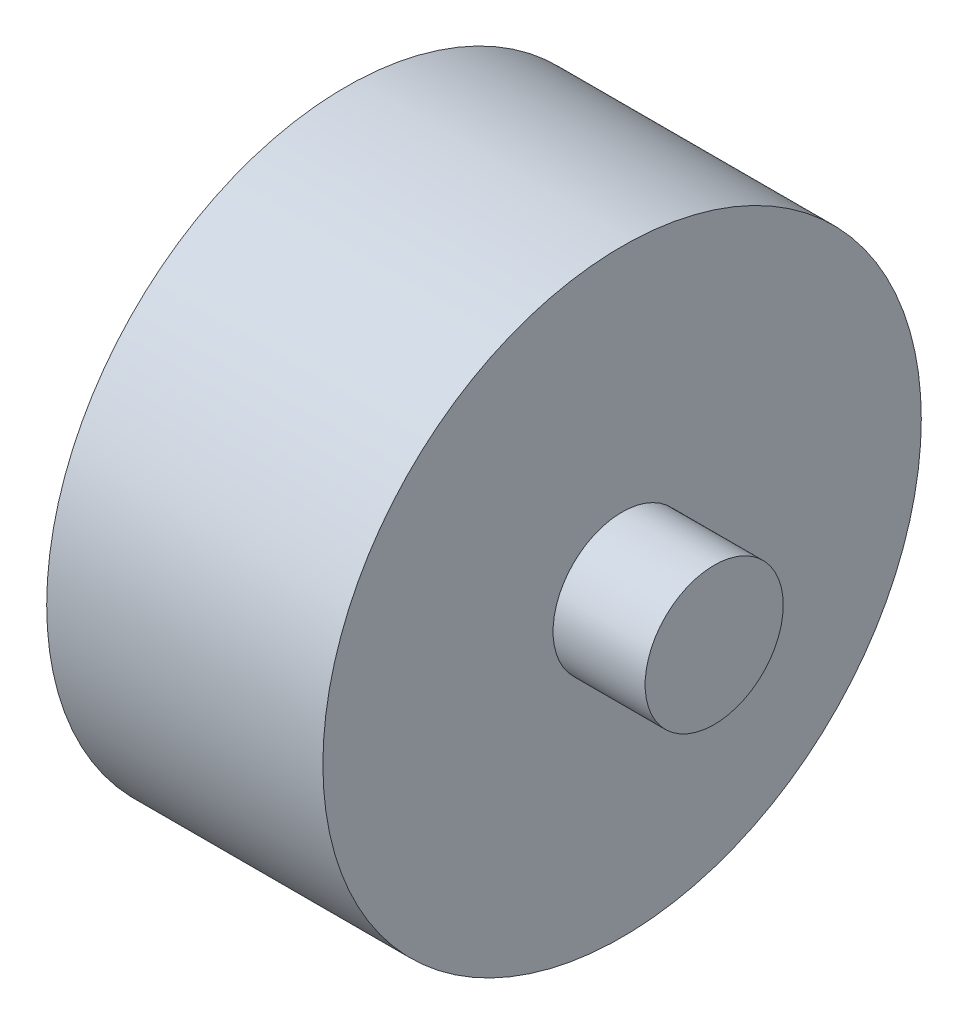
ISO-10303-21;
HEADER;
FILE_DESCRIPTION(('STEP AP214'),'2;1');
FILE_NAME('part.step','',(''),(''),'','','');
FILE_SCHEMA(('AUTOMOTIVE_DESIGN { 1 0 10303 214 1 1 1 1 }'));
ENDSEC;
DATA;
#1=APPLICATION_CONTEXT('core data for automotive mechanical design processes');
#2=APPLICATION_PROTOCOL_DEFINITION('international standard','automotive_design',2000,#1);
#3=PRODUCT_CONTEXT('',#1,'mechanical');
#4=PRODUCT('Part','Part','',(#3));
#5=PRODUCT_RELATED_PRODUCT_CATEGORY('part','',(#4));
#6=PRODUCT_DEFINITION_FORMATION('','',#4);
#7=PRODUCT_DEFINITION_CONTEXT('part definition',#1,'design');
#8=PRODUCT_DEFINITION('design','',#6,#7);
#9=PRODUCT_DEFINITION_SHAPE('','',#8);
#10=(LENGTH_UNIT() NAMED_UNIT(*) SI_UNIT(.MILLI.,.METRE.));
#11=(NAMED_UNIT(*) PLANE_ANGLE_UNIT() SI_UNIT($,.RADIAN.));
#12=(NAMED_UNIT(*) SI_UNIT($,.STERADIAN.) SOLID_ANGLE_UNIT());
#13=UNCERTAINTY_MEASURE_WITH_UNIT(LENGTH_MEASURE(1.E-05),#10,'distance_accuracy_value','');
#14=(GEOMETRIC_REPRESENTATION_CONTEXT(3) GLOBAL_UNCERTAINTY_ASSIGNED_CONTEXT((#13)) GLOBAL_UNIT_ASSIGNED_CONTEXT((#10,
#11,#12)) REPRESENTATION_CONTEXT('',''));
#15=CARTESIAN_POINT('',(0.,0.,0.));
#16=DIRECTION('',(0.,0.,1.));
#17=DIRECTION('',(1.,0.,0.));
#18=AXIS2_PLACEMENT_3D('',#15,#16,#17);
#19=CARTESIAN_POINT('',(60.,0.,0.));
#20=DIRECTION('',(-1.,0.,0.));
#21=DIRECTION('',(0.,0.,1.));
#22=AXIS2_PLACEMENT_3D('',#19,#20,#21);
#23=CYLINDRICAL_SURFACE('',#22,65.);
#24=CARTESIAN_POINT('',(60.,0.,0.));
#25=DIRECTION('',(1.,0.,0.));
#26=DIRECTION('',(0.,0.,-1.));
#27=AXIS2_PLACEMENT_3D('',#24,#25,#26);
#28=CIRCLE('',#27,65.);
#29=CARTESIAN_POINT('',(60.,0.,-65.));
#30=VERTEX_POINT('',#29);
#31=EDGE_CURVE('E38',#30,#30,#28,.T.);
#32=ORIENTED_EDGE('',*,*,#31,.F.);
#33=EDGE_LOOP('',(#32));
#34=FACE_BOUND('',#33,.T.);
#35=CARTESIAN_POINT('',(0.,0.,0.));
#36=DIRECTION('',(1.,0.,0.));
#37=DIRECTION('',(0.,0.,-1.));
#38=AXIS2_PLACEMENT_3D('',#35,#36,#37);
#39=CIRCLE('',#38,65.);
#40=CARTESIAN_POINT('',(0.,0.,-65.));
#41=VERTEX_POINT('',#40);
#42=EDGE_CURVE('E34',#41,#41,#39,.T.);
#43=ORIENTED_EDGE('',*,*,#42,.T.);
#44=EDGE_LOOP('',(#43));
#45=FACE_BOUND('',#44,.T.);
#46=ADVANCED_FACE('F31',(#34,#45),#23,.T.);
#47=CARTESIAN_POINT('',(60.,0.,0.));
#48=DIRECTION('',(1.,0.,0.));
#49=DIRECTION('',(0.,0.,-1.));
#50=AXIS2_PLACEMENT_3D('',#47,#48,#49);
#51=PLANE('',#50);
#52=CARTESIAN_POINT('',(60.,0.,0.));
#53=DIRECTION('',(1.,0.,0.));
#54=DIRECTION('',(0.,0.,-1.));
#55=AXIS2_PLACEMENT_3D('',#52,#53,#54);
#56=CIRCLE('',#55,15.);
#57=CARTESIAN_POINT('',(60.,0.,-15.));
#58=VERTEX_POINT('',#57);
#59=EDGE_CURVE('E10',#58,#58,#56,.T.);
#60=ORIENTED_EDGE('',*,*,#59,.F.);
#61=EDGE_LOOP('',(#60));
#62=FACE_BOUND('',#61,.T.);
#63=ORIENTED_EDGE('',*,*,#31,.T.);
#64=EDGE_LOOP('',(#63));
#65=FACE_BOUND('',#64,.T.);
#66=ADVANCED_FACE('F55',(#62,#65),#51,.T.);
#67=CARTESIAN_POINT('',(0.,0.,0.));
#68=DIRECTION('',(1.,0.,0.));
#69=DIRECTION('',(0.,0.,-1.));
#70=AXIS2_PLACEMENT_3D('',#67,#68,#69);
#71=PLANE('',#70);
#72=ORIENTED_EDGE('',*,*,#42,.F.);
#73=EDGE_LOOP('',(#72));
#74=FACE_BOUND('',#73,.T.);
#75=ADVANCED_FACE('F52',(#74),#71,.F.);
#76=CARTESIAN_POINT('',(80.,0.,0.));
#77=DIRECTION('',(-1.,0.,0.));
#78=DIRECTION('',(0.,0.,1.));
#79=AXIS2_PLACEMENT_3D('',#76,#77,#78);
#80=CYLINDRICAL_SURFACE('',#79,15.);
#81=CARTESIAN_POINT('',(80.,0.,0.));
#82=DIRECTION('',(1.,0.,0.));
#83=DIRECTION('',(0.,0.,-1.));
#84=AXIS2_PLACEMENT_3D('',#81,#82,#83);
#85=CIRCLE('',#84,15.);
#86=CARTESIAN_POINT('',(80.,0.,-15.));
#87=VERTEX_POINT('',#86);
#88=EDGE_CURVE('E44',#87,#87,#85,.T.);
#89=ORIENTED_EDGE('',*,*,#88,.F.);
#90=EDGE_LOOP('',(#89));
#91=FACE_BOUND('',#90,.T.);
#92=ORIENTED_EDGE('',*,*,#59,.T.);
#93=EDGE_LOOP('',(#92));
#94=FACE_BOUND('',#93,.T.);
#95=ADVANCED_FACE('F54',(#91,#94),#80,.T.);
#96=CARTESIAN_POINT('',(80.,0.,0.));
#97=DIRECTION('',(1.,0.,0.));
#98=DIRECTION('',(0.,0.,-1.));
#99=AXIS2_PLACEMENT_3D('',#96,#97,#98);
#100=PLANE('',#99);
#101=ORIENTED_EDGE('',*,*,#88,.T.);
#102=EDGE_LOOP('',(#101));
#103=FACE_BOUND('',#102,.T.);
#104=ADVANCED_FACE('F60',(#103),#100,.T.);
#105=CLOSED_SHELL('',(#46,#66,#75,#95,#104));
#106=MANIFOLD_SOLID_BREP('B2',#105);
#107=ADVANCED_BREP_SHAPE_REPRESENTATION('',(#18,#106),#14);
#108=SHAPE_DEFINITION_REPRESENTATION(#9,#107);
ENDSEC;
END-ISO-10303-21;
